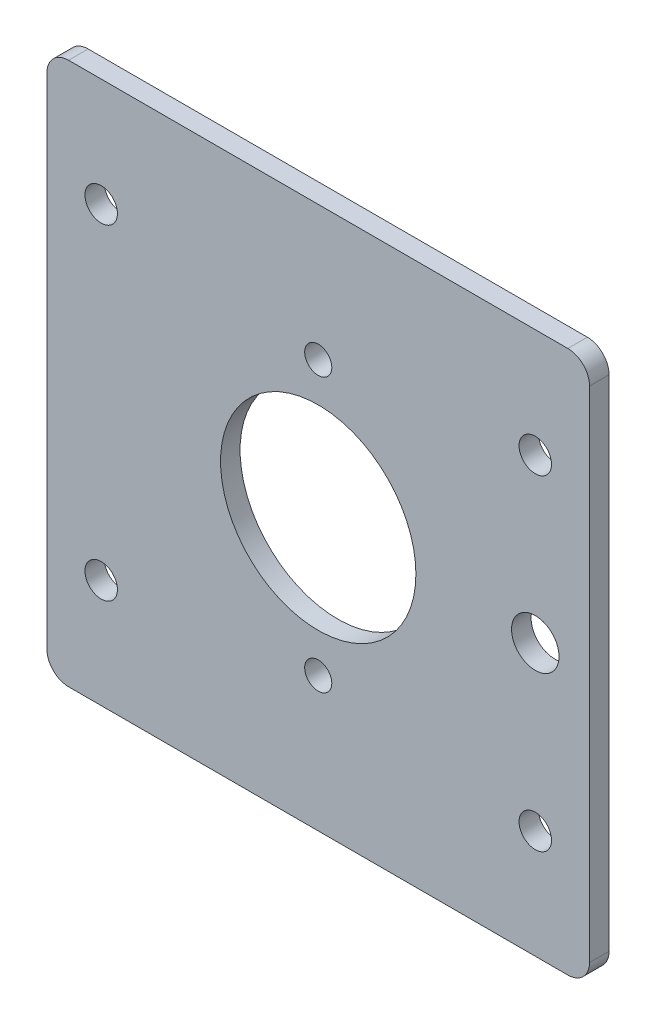
ISO-10303-21;
HEADER;
FILE_DESCRIPTION(('STEP AP214'),'2;1');
FILE_NAME('part.step','',(''),(''),'','','');
FILE_SCHEMA(('AUTOMOTIVE_DESIGN { 1 0 10303 214 1 1 1 1 }'));
ENDSEC;
DATA;
#1=APPLICATION_CONTEXT('core data for automotive mechanical design processes');
#2=APPLICATION_PROTOCOL_DEFINITION('international standard','automotive_design',2000,#1);
#3=PRODUCT_CONTEXT('',#1,'mechanical');
#4=PRODUCT('Part','Part','',(#3));
#5=PRODUCT_RELATED_PRODUCT_CATEGORY('part','',(#4));
#6=PRODUCT_DEFINITION_FORMATION('','',#4);
#7=PRODUCT_DEFINITION_CONTEXT('part definition',#1,'design');
#8=PRODUCT_DEFINITION('design','',#6,#7);
#9=PRODUCT_DEFINITION_SHAPE('','',#8);
#10=(LENGTH_UNIT() NAMED_UNIT(*) SI_UNIT(.MILLI.,.METRE.));
#11=(NAMED_UNIT(*) PLANE_ANGLE_UNIT() SI_UNIT($,.RADIAN.));
#12=(NAMED_UNIT(*) SI_UNIT($,.STERADIAN.) SOLID_ANGLE_UNIT());
#13=UNCERTAINTY_MEASURE_WITH_UNIT(LENGTH_MEASURE(1.E-05),#10,'distance_accuracy_value','');
#14=(GEOMETRIC_REPRESENTATION_CONTEXT(3) GLOBAL_UNCERTAINTY_ASSIGNED_CONTEXT((#13)) GLOBAL_UNIT_ASSIGNED_CONTEXT((#10,
#11,#12)) REPRESENTATION_CONTEXT('',''));
#15=CARTESIAN_POINT('',(0.,0.,0.));
#16=DIRECTION('',(0.,0.,1.));
#17=DIRECTION('',(1.,0.,0.));
#18=AXIS2_PLACEMENT_3D('',#15,#16,#17);
#19=CARTESIAN_POINT('',(31.75,31.75,-2.286));
#20=DIRECTION('',(0.,0.,1.));
#21=DIRECTION('',(1.,0.,0.));
#22=AXIS2_PLACEMENT_3D('',#19,#20,#21);
#23=PLANE('',#22);
#24=CARTESIAN_POINT('',(0.,16.,-2.28599999999999));
#25=DIRECTION('',(0.,0.,1.));
#26=DIRECTION('',(1.,0.,0.));
#27=AXIS2_PLACEMENT_3D('',#24,#25,#26);
#28=CIRCLE('',#27,1.5875);
#29=CARTESIAN_POINT('',(1.5875,16.,-2.28599999999999));
#30=VERTEX_POINT('',#29);
#31=EDGE_CURVE('E225',#30,#30,#28,.T.);
#32=ORIENTED_EDGE('',*,*,#31,.T.);
#33=EDGE_LOOP('',(#32));
#34=FACE_BOUND('',#33,.T.);
#35=CARTESIAN_POINT('',(0.,-16.,-2.28599999999999));
#36=DIRECTION('',(0.,0.,1.));
#37=DIRECTION('',(1.,0.,0.));
#38=AXIS2_PLACEMENT_3D('',#35,#36,#37);
#39=CIRCLE('',#38,1.5875);
#40=CARTESIAN_POINT('',(1.5875,-16.,-2.28599999999999));
#41=VERTEX_POINT('',#40);
#42=EDGE_CURVE('E219',#41,#41,#39,.T.);
#43=ORIENTED_EDGE('',*,*,#42,.T.);
#44=EDGE_LOOP('',(#43));
#45=FACE_BOUND('',#44,.T.);
#46=CARTESIAN_POINT('',(25.4,0.,-2.286));
#47=DIRECTION('',(0.,0.,1.));
#48=DIRECTION('',(1.,0.,0.));
#49=AXIS2_PLACEMENT_3D('',#46,#47,#48);
#50=CIRCLE('',#49,2.778125);
#51=CARTESIAN_POINT('',(28.178125,0.,-2.286));
#52=VERTEX_POINT('',#51);
#53=EDGE_CURVE('E211',#52,#52,#50,.T.);
#54=ORIENTED_EDGE('',*,*,#53,.T.);
#55=EDGE_LOOP('',(#54));
#56=FACE_BOUND('',#55,.T.);
#57=CARTESIAN_POINT('',(0.,0.,-2.286));
#58=DIRECTION('',(0.,0.,1.));
#59=DIRECTION('',(1.,0.,0.));
#60=AXIS2_PLACEMENT_3D('',#57,#58,#59);
#61=CIRCLE('',#60,11.43);
#62=CARTESIAN_POINT('',(11.43,0.,-2.286));
#63=VERTEX_POINT('',#62);
#64=EDGE_CURVE('E207',#63,#63,#61,.T.);
#65=ORIENTED_EDGE('',*,*,#64,.T.);
#66=EDGE_LOOP('',(#65));
#67=FACE_BOUND('',#66,.T.);
#68=CARTESIAN_POINT('',(-25.4,19.05,-2.286));
#69=DIRECTION('',(0.,0.,1.));
#70=DIRECTION('',(1.,0.,0.));
#71=AXIS2_PLACEMENT_3D('',#68,#69,#70);
#72=CIRCLE('',#71,1.89865);
#73=CARTESIAN_POINT('',(-23.50135,19.05,-2.286));
#74=VERTEX_POINT('',#73);
#75=EDGE_CURVE('E201',#74,#74,#72,.T.);
#76=ORIENTED_EDGE('',*,*,#75,.T.);
#77=EDGE_LOOP('',(#76));
#78=FACE_BOUND('',#77,.T.);
#79=CARTESIAN_POINT('',(25.4,19.05,-2.286));
#80=DIRECTION('',(0.,0.,1.));
#81=DIRECTION('',(1.,0.,0.));
#82=AXIS2_PLACEMENT_3D('',#79,#80,#81);
#83=CIRCLE('',#82,1.89865);
#84=CARTESIAN_POINT('',(27.29865,19.05,-2.286));
#85=VERTEX_POINT('',#84);
#86=EDGE_CURVE('E195',#85,#85,#83,.T.);
#87=ORIENTED_EDGE('',*,*,#86,.T.);
#88=EDGE_LOOP('',(#87));
#89=FACE_BOUND('',#88,.T.);
#90=CARTESIAN_POINT('',(25.4,-19.05,-2.286));
#91=DIRECTION('',(0.,0.,1.));
#92=DIRECTION('',(1.,0.,0.));
#93=AXIS2_PLACEMENT_3D('',#90,#91,#92);
#94=CIRCLE('',#93,1.89865);
#95=CARTESIAN_POINT('',(27.29865,-19.05,-2.286));
#96=VERTEX_POINT('',#95);
#97=EDGE_CURVE('E189',#96,#96,#94,.T.);
#98=ORIENTED_EDGE('',*,*,#97,.T.);
#99=EDGE_LOOP('',(#98));
#100=FACE_BOUND('',#99,.T.);
#101=CARTESIAN_POINT('',(-25.4,-19.05,-2.286));
#102=DIRECTION('',(0.,0.,1.));
#103=DIRECTION('',(1.,0.,0.));
#104=AXIS2_PLACEMENT_3D('',#101,#102,#103);
#105=CIRCLE('',#104,1.89865);
#106=CARTESIAN_POINT('',(-23.50135,-19.05,-2.286));
#107=VERTEX_POINT('',#106);
#108=EDGE_CURVE('E130',#107,#107,#105,.T.);
#109=ORIENTED_EDGE('',*,*,#108,.T.);
#110=EDGE_LOOP('',(#109));
#111=FACE_BOUND('',#110,.T.);
#112=DIRECTION('',(0.,-1.,0.));
#113=VECTOR('',#112,1.);
#114=CARTESIAN_POINT('',(31.75,31.75,-2.286));
#115=LINE('',#114,#113);
#116=CARTESIAN_POINT('',(31.75,29.21,-2.286));
#117=VERTEX_POINT('',#116);
#118=CARTESIAN_POINT('',(31.75,-29.21,-2.286));
#119=VERTEX_POINT('',#118);
#120=EDGE_CURVE('E113',#117,#119,#115,.T.);
#121=ORIENTED_EDGE('',*,*,#120,.T.);
#122=CARTESIAN_POINT('',(29.21,-29.21,-2.286));
#123=DIRECTION('',(0.,0.,1.));
#124=DIRECTION('',(1.,0.,0.));
#125=AXIS2_PLACEMENT_3D('',#122,#123,#124);
#126=CIRCLE('',#125,2.54);
#127=CARTESIAN_POINT('',(29.21,-31.75,-2.286));
#128=VERTEX_POINT('',#127);
#129=EDGE_CURVE('E109',#119,#128,#126,.F.);
#130=ORIENTED_EDGE('',*,*,#129,.T.);
#131=DIRECTION('',(-1.,0.,0.));
#132=VECTOR('',#131,1.);
#133=CARTESIAN_POINT('',(31.75,-31.75,-2.286));
#134=LINE('',#133,#132);
#135=CARTESIAN_POINT('',(-29.21,-31.75,-2.28599999999999));
#136=VERTEX_POINT('',#135);
#137=EDGE_CURVE('E111',#128,#136,#134,.T.);
#138=ORIENTED_EDGE('',*,*,#137,.T.);
#139=CARTESIAN_POINT('',(-29.21,-29.21,-2.28599999999999));
#140=DIRECTION('',(0.,0.,1.));
#141=DIRECTION('',(1.,0.,0.));
#142=AXIS2_PLACEMENT_3D('',#139,#140,#141);
#143=CIRCLE('',#142,2.54);
#144=CARTESIAN_POINT('',(-31.75,-29.21,-2.28599999999999));
#145=VERTEX_POINT('',#144);
#146=EDGE_CURVE('E118',#136,#145,#143,.F.);
#147=ORIENTED_EDGE('',*,*,#146,.T.);
#148=DIRECTION('',(0.,-1.,0.));
#149=VECTOR('',#148,1.);
#150=CARTESIAN_POINT('',(-31.75,31.75,-2.28599999999999));
#151=LINE('',#150,#149);
#152=CARTESIAN_POINT('',(-31.75,29.21,-2.28599999999999));
#153=VERTEX_POINT('',#152);
#154=EDGE_CURVE('E138',#153,#145,#151,.T.);
#155=ORIENTED_EDGE('',*,*,#154,.F.);
#156=CARTESIAN_POINT('',(-29.21,29.21,-2.28599999999999));
#157=DIRECTION('',(0.,0.,1.));
#158=DIRECTION('',(1.,0.,0.));
#159=AXIS2_PLACEMENT_3D('',#156,#157,#158);
#160=CIRCLE('',#159,2.54);
#161=CARTESIAN_POINT('',(-29.21,31.75,-2.28599999999999));
#162=VERTEX_POINT('',#161);
#163=EDGE_CURVE('E60',#153,#162,#160,.F.);
#164=ORIENTED_EDGE('',*,*,#163,.T.);
#165=DIRECTION('',(-1.,0.,0.));
#166=VECTOR('',#165,1.);
#167=CARTESIAN_POINT('',(31.75,31.75,-2.286));
#168=LINE('',#167,#166);
#169=CARTESIAN_POINT('',(29.21,31.75,-2.286));
#170=VERTEX_POINT('',#169);
#171=EDGE_CURVE('E180',#170,#162,#168,.T.);
#172=ORIENTED_EDGE('',*,*,#171,.F.);
#173=CARTESIAN_POINT('',(29.21,29.21,-2.286));
#174=DIRECTION('',(0.,0.,1.));
#175=DIRECTION('',(1.,0.,0.));
#176=AXIS2_PLACEMENT_3D('',#173,#174,#175);
#177=CIRCLE('',#176,2.54);
#178=EDGE_CURVE('E151',#170,#117,#177,.F.);
#179=ORIENTED_EDGE('',*,*,#178,.T.);
#180=EDGE_LOOP('',(#121,#130,#138,#147,#155,#164,#172,#179));
#181=FACE_BOUND('',#180,.T.);
#182=ADVANCED_FACE('F45',(#34,#45,#56,#67,#78,#89,#100,#111,#181),#23,.F.);
#183=CARTESIAN_POINT('',(-31.75,31.75,0.));
#184=DIRECTION('',(-1.,0.,0.));
#185=DIRECTION('',(0.,0.,1.));
#186=AXIS2_PLACEMENT_3D('',#183,#184,#185);
#187=PLANE('',#186);
#188=ORIENTED_EDGE('',*,*,#154,.T.);
#189=DIRECTION('',(0.,0.,-1.));
#190=VECTOR('',#189,1.);
#191=CARTESIAN_POINT('',(-31.75,-29.21,0.));
#192=LINE('',#191,#190);
#193=CARTESIAN_POINT('',(-31.75,-29.21,0.));
#194=VERTEX_POINT('',#193);
#195=EDGE_CURVE('E157',#145,#194,#192,.F.);
#196=ORIENTED_EDGE('',*,*,#195,.T.);
#197=DIRECTION('',(0.,-1.,0.));
#198=VECTOR('',#197,1.);
#199=CARTESIAN_POINT('',(-31.75,31.75,0.));
#200=LINE('',#199,#198);
#201=CARTESIAN_POINT('',(-31.75,29.21,0.));
#202=VERTEX_POINT('',#201);
#203=EDGE_CURVE('E164',#202,#194,#200,.T.);
#204=ORIENTED_EDGE('',*,*,#203,.F.);
#205=DIRECTION('',(0.,0.,-1.));
#206=VECTOR('',#205,1.);
#207=CARTESIAN_POINT('',(-31.75,29.21,-2.28599999999999));
#208=LINE('',#207,#206);
#209=EDGE_CURVE('E117',#202,#153,#208,.T.);
#210=ORIENTED_EDGE('',*,*,#209,.T.);
#211=EDGE_LOOP('',(#188,#196,#204,#210));
#212=FACE_BOUND('',#211,.T.);
#213=ADVANCED_FACE('F163',(#212),#187,.T.);
#214=CARTESIAN_POINT('',(31.75,31.75,0.));
#215=DIRECTION('',(0.,0.,1.));
#216=DIRECTION('',(1.,0.,0.));
#217=AXIS2_PLACEMENT_3D('',#214,#215,#216);
#218=PLANE('',#217);
#219=CARTESIAN_POINT('',(0.,16.,0.));
#220=DIRECTION('',(0.,0.,1.));
#221=DIRECTION('',(1.,0.,0.));
#222=AXIS2_PLACEMENT_3D('',#219,#220,#221);
#223=CIRCLE('',#222,1.5875);
#224=CARTESIAN_POINT('',(1.5875,16.,0.));
#225=VERTEX_POINT('',#224);
#226=EDGE_CURVE('E228',#225,#225,#223,.T.);
#227=ORIENTED_EDGE('',*,*,#226,.F.);
#228=EDGE_LOOP('',(#227));
#229=FACE_BOUND('',#228,.T.);
#230=CARTESIAN_POINT('',(0.,-16.,0.));
#231=DIRECTION('',(0.,0.,1.));
#232=DIRECTION('',(1.,0.,0.));
#233=AXIS2_PLACEMENT_3D('',#230,#231,#232);
#234=CIRCLE('',#233,1.5875);
#235=CARTESIAN_POINT('',(1.5875,-16.,0.));
#236=VERTEX_POINT('',#235);
#237=EDGE_CURVE('E222',#236,#236,#234,.T.);
#238=ORIENTED_EDGE('',*,*,#237,.F.);
#239=EDGE_LOOP('',(#238));
#240=FACE_BOUND('',#239,.T.);
#241=CARTESIAN_POINT('',(25.4,0.,0.));
#242=DIRECTION('',(0.,0.,1.));
#243=DIRECTION('',(1.,0.,0.));
#244=AXIS2_PLACEMENT_3D('',#241,#242,#243);
#245=CIRCLE('',#244,2.77812499999999);
#246=CARTESIAN_POINT('',(28.178125,0.,0.));
#247=VERTEX_POINT('',#246);
#248=EDGE_CURVE('E216',#247,#247,#245,.T.);
#249=ORIENTED_EDGE('',*,*,#248,.F.);
#250=EDGE_LOOP('',(#249));
#251=FACE_BOUND('',#250,.T.);
#252=CARTESIAN_POINT('',(0.,0.,0.));
#253=DIRECTION('',(0.,0.,1.));
#254=DIRECTION('',(1.,0.,0.));
#255=AXIS2_PLACEMENT_3D('',#252,#253,#254);
#256=CIRCLE('',#255,11.43);
#257=CARTESIAN_POINT('',(11.43,0.,0.));
#258=VERTEX_POINT('',#257);
#259=EDGE_CURVE('E208',#258,#258,#256,.T.);
#260=ORIENTED_EDGE('',*,*,#259,.F.);
#261=EDGE_LOOP('',(#260));
#262=FACE_BOUND('',#261,.T.);
#263=CARTESIAN_POINT('',(-25.4,19.05,0.));
#264=DIRECTION('',(0.,0.,1.));
#265=DIRECTION('',(1.,0.,0.));
#266=AXIS2_PLACEMENT_3D('',#263,#264,#265);
#267=CIRCLE('',#266,1.89865);
#268=CARTESIAN_POINT('',(-23.50135,19.05,0.));
#269=VERTEX_POINT('',#268);
#270=EDGE_CURVE('E204',#269,#269,#267,.T.);
#271=ORIENTED_EDGE('',*,*,#270,.F.);
#272=EDGE_LOOP('',(#271));
#273=FACE_BOUND('',#272,.T.);
#274=CARTESIAN_POINT('',(25.4,19.05,0.));
#275=DIRECTION('',(0.,0.,1.));
#276=DIRECTION('',(1.,0.,0.));
#277=AXIS2_PLACEMENT_3D('',#274,#275,#276);
#278=CIRCLE('',#277,1.89865);
#279=CARTESIAN_POINT('',(27.29865,19.05,0.));
#280=VERTEX_POINT('',#279);
#281=EDGE_CURVE('E198',#280,#280,#278,.T.);
#282=ORIENTED_EDGE('',*,*,#281,.F.);
#283=EDGE_LOOP('',(#282));
#284=FACE_BOUND('',#283,.T.);
#285=CARTESIAN_POINT('',(25.4,-19.05,0.));
#286=DIRECTION('',(0.,0.,1.));
#287=DIRECTION('',(1.,0.,0.));
#288=AXIS2_PLACEMENT_3D('',#285,#286,#287);
#289=CIRCLE('',#288,1.89865);
#290=CARTESIAN_POINT('',(27.29865,-19.05,0.));
#291=VERTEX_POINT('',#290);
#292=EDGE_CURVE('E192',#291,#291,#289,.T.);
#293=ORIENTED_EDGE('',*,*,#292,.F.);
#294=EDGE_LOOP('',(#293));
#295=FACE_BOUND('',#294,.T.);
#296=CARTESIAN_POINT('',(-25.4,-19.05,0.));
#297=DIRECTION('',(0.,0.,1.));
#298=DIRECTION('',(1.,0.,0.));
#299=AXIS2_PLACEMENT_3D('',#296,#297,#298);
#300=CIRCLE('',#299,1.89865);
#301=CARTESIAN_POINT('',(-23.50135,-19.05,0.));
#302=VERTEX_POINT('',#301);
#303=EDGE_CURVE('E186',#302,#302,#300,.T.);
#304=ORIENTED_EDGE('',*,*,#303,.F.);
#305=EDGE_LOOP('',(#304));
#306=FACE_BOUND('',#305,.T.);
#307=DIRECTION('',(-1.,0.,0.));
#308=VECTOR('',#307,1.);
#309=CARTESIAN_POINT('',(31.75,-31.75,0.));
#310=LINE('',#309,#308);
#311=CARTESIAN_POINT('',(29.21,-31.75,0.));
#312=VERTEX_POINT('',#311);
#313=CARTESIAN_POINT('',(-29.21,-31.75,0.));
#314=VERTEX_POINT('',#313);
#315=EDGE_CURVE('E129',#312,#314,#310,.T.);
#316=ORIENTED_EDGE('',*,*,#315,.F.);
#317=CARTESIAN_POINT('',(29.21,-29.21,0.));
#318=DIRECTION('',(0.,0.,1.));
#319=DIRECTION('',(1.,0.,0.));
#320=AXIS2_PLACEMENT_3D('',#317,#318,#319);
#321=CIRCLE('',#320,2.54);
#322=CARTESIAN_POINT('',(31.75,-29.21,0.));
#323=VERTEX_POINT('',#322);
#324=EDGE_CURVE('E133',#312,#323,#321,.T.);
#325=ORIENTED_EDGE('',*,*,#324,.T.);
#326=DIRECTION('',(0.,-1.,0.));
#327=VECTOR('',#326,1.);
#328=CARTESIAN_POINT('',(31.75,31.75,0.));
#329=LINE('',#328,#327);
#330=CARTESIAN_POINT('',(31.75,29.21,0.));
#331=VERTEX_POINT('',#330);
#332=EDGE_CURVE('E172',#331,#323,#329,.T.);
#333=ORIENTED_EDGE('',*,*,#332,.F.);
#334=CARTESIAN_POINT('',(29.21,29.21,0.));
#335=DIRECTION('',(0.,0.,1.));
#336=DIRECTION('',(1.,0.,0.));
#337=AXIS2_PLACEMENT_3D('',#334,#335,#336);
#338=CIRCLE('',#337,2.54);
#339=CARTESIAN_POINT('',(29.21,31.75,0.));
#340=VERTEX_POINT('',#339);
#341=EDGE_CURVE('E134',#331,#340,#338,.T.);
#342=ORIENTED_EDGE('',*,*,#341,.T.);
#343=DIRECTION('',(-1.,0.,0.));
#344=VECTOR('',#343,1.);
#345=CARTESIAN_POINT('',(31.75,31.75,0.));
#346=LINE('',#345,#344);
#347=CARTESIAN_POINT('',(-29.21,31.75,0.));
#348=VERTEX_POINT('',#347);
#349=EDGE_CURVE('E179',#340,#348,#346,.T.);
#350=ORIENTED_EDGE('',*,*,#349,.T.);
#351=CARTESIAN_POINT('',(-29.21,29.21,0.));
#352=DIRECTION('',(0.,0.,1.));
#353=DIRECTION('',(1.,0.,0.));
#354=AXIS2_PLACEMENT_3D('',#351,#352,#353);
#355=CIRCLE('',#354,2.54);
#356=EDGE_CURVE('E136',#348,#202,#355,.T.);
#357=ORIENTED_EDGE('',*,*,#356,.T.);
#358=ORIENTED_EDGE('',*,*,#203,.T.);
#359=CARTESIAN_POINT('',(-29.21,-29.21,0.));
#360=DIRECTION('',(0.,0.,1.));
#361=DIRECTION('',(1.,0.,0.));
#362=AXIS2_PLACEMENT_3D('',#359,#360,#361);
#363=CIRCLE('',#362,2.54);
#364=EDGE_CURVE('E143',#194,#314,#363,.T.);
#365=ORIENTED_EDGE('',*,*,#364,.T.);
#366=EDGE_LOOP('',(#316,#325,#333,#342,#350,#357,#358,#365));
#367=FACE_BOUND('',#366,.T.);
#368=ADVANCED_FACE('F169',(#229,#240,#251,#262,#273,#284,#295,#306,#367),#218,.T.);
#369=CARTESIAN_POINT('',(31.75,31.75,-2.286));
#370=DIRECTION('',(1.,0.,0.));
#371=DIRECTION('',(0.,0.,-1.));
#372=AXIS2_PLACEMENT_3D('',#369,#370,#371);
#373=PLANE('',#372);
#374=ORIENTED_EDGE('',*,*,#332,.T.);
#375=DIRECTION('',(0.,0.,1.));
#376=VECTOR('',#375,1.);
#377=CARTESIAN_POINT('',(31.75,-29.21,-2.286));
#378=LINE('',#377,#376);
#379=EDGE_CURVE('E149',#323,#119,#378,.F.);
#380=ORIENTED_EDGE('',*,*,#379,.T.);
#381=ORIENTED_EDGE('',*,*,#120,.F.);
#382=DIRECTION('',(0.,0.,1.));
#383=VECTOR('',#382,1.);
#384=CARTESIAN_POINT('',(31.75,29.21,0.));
#385=LINE('',#384,#383);
#386=EDGE_CURVE('E146',#117,#331,#385,.T.);
#387=ORIENTED_EDGE('',*,*,#386,.T.);
#388=EDGE_LOOP('',(#374,#380,#381,#387));
#389=FACE_BOUND('',#388,.T.);
#390=ADVANCED_FACE('F236',(#389),#373,.T.);
#391=CARTESIAN_POINT('',(0.,31.75,0.));
#392=DIRECTION('',(0.,-1.,0.));
#393=DIRECTION('',(1.,0.,0.));
#394=AXIS2_PLACEMENT_3D('',#391,#392,#393);
#395=PLANE('',#394);
#396=ORIENTED_EDGE('',*,*,#171,.T.);
#397=DIRECTION('',(0.,0.,-1.));
#398=VECTOR('',#397,1.);
#399=CARTESIAN_POINT('',(-29.21,31.75,0.));
#400=LINE('',#399,#398);
#401=EDGE_CURVE('E11',#162,#348,#400,.F.);
#402=ORIENTED_EDGE('',*,*,#401,.T.);
#403=ORIENTED_EDGE('',*,*,#349,.F.);
#404=DIRECTION('',(0.,0.,1.));
#405=VECTOR('',#404,1.);
#406=CARTESIAN_POINT('',(29.21,31.75,-2.286));
#407=LINE('',#406,#405);
#408=EDGE_CURVE('E53',#340,#170,#407,.F.);
#409=ORIENTED_EDGE('',*,*,#408,.T.);
#410=EDGE_LOOP('',(#396,#402,#403,#409));
#411=FACE_BOUND('',#410,.T.);
#412=ADVANCED_FACE('F286',(#411),#395,.F.);
#413=CARTESIAN_POINT('',(0.,-31.75,0.));
#414=DIRECTION('',(0.,-1.,0.));
#415=DIRECTION('',(1.,0.,0.));
#416=AXIS2_PLACEMENT_3D('',#413,#414,#415);
#417=PLANE('',#416);
#418=ORIENTED_EDGE('',*,*,#137,.F.);
#419=DIRECTION('',(0.,0.,1.));
#420=VECTOR('',#419,1.);
#421=CARTESIAN_POINT('',(29.21,-31.75,0.));
#422=LINE('',#421,#420);
#423=EDGE_CURVE('E125',#128,#312,#422,.T.);
#424=ORIENTED_EDGE('',*,*,#423,.T.);
#425=ORIENTED_EDGE('',*,*,#315,.T.);
#426=DIRECTION('',(0.,0.,-1.));
#427=VECTOR('',#426,1.);
#428=CARTESIAN_POINT('',(-29.21,-31.75,0.));
#429=LINE('',#428,#427);
#430=EDGE_CURVE('E128',#314,#136,#429,.T.);
#431=ORIENTED_EDGE('',*,*,#430,.T.);
#432=EDGE_LOOP('',(#418,#424,#425,#431));
#433=FACE_BOUND('',#432,.T.);
#434=ADVANCED_FACE('F123',(#433),#417,.T.);
#435=CARTESIAN_POINT('',(29.21,-29.21,0.));
#436=DIRECTION('',(0.,0.,1.));
#437=DIRECTION('',(1.,0.,0.));
#438=AXIS2_PLACEMENT_3D('',#435,#436,#437);
#439=CYLINDRICAL_SURFACE('',#438,2.54);
#440=ORIENTED_EDGE('',*,*,#129,.F.);
#441=ORIENTED_EDGE('',*,*,#379,.F.);
#442=ORIENTED_EDGE('',*,*,#324,.F.);
#443=ORIENTED_EDGE('',*,*,#423,.F.);
#444=EDGE_LOOP('',(#440,#441,#442,#443));
#445=FACE_BOUND('',#444,.T.);
#446=ADVANCED_FACE('F132',(#445),#439,.T.);
#447=CARTESIAN_POINT('',(-29.21,-29.21,0.));
#448=DIRECTION('',(0.,0.,-1.));
#449=DIRECTION('',(-1.,0.,0.));
#450=AXIS2_PLACEMENT_3D('',#447,#448,#449);
#451=CYLINDRICAL_SURFACE('',#450,2.54);
#452=ORIENTED_EDGE('',*,*,#364,.F.);
#453=ORIENTED_EDGE('',*,*,#195,.F.);
#454=ORIENTED_EDGE('',*,*,#146,.F.);
#455=ORIENTED_EDGE('',*,*,#430,.F.);
#456=EDGE_LOOP('',(#452,#453,#454,#455));
#457=FACE_BOUND('',#456,.T.);
#458=ADVANCED_FACE('F174',(#457),#451,.T.);
#459=CARTESIAN_POINT('',(-29.21,29.21,0.));
#460=DIRECTION('',(0.,0.,1.));
#461=DIRECTION('',(1.,0.,0.));
#462=AXIS2_PLACEMENT_3D('',#459,#460,#461);
#463=CYLINDRICAL_SURFACE('',#462,2.54);
#464=ORIENTED_EDGE('',*,*,#356,.F.);
#465=ORIENTED_EDGE('',*,*,#401,.F.);
#466=ORIENTED_EDGE('',*,*,#163,.F.);
#467=ORIENTED_EDGE('',*,*,#209,.F.);
#468=EDGE_LOOP('',(#464,#465,#466,#467));
#469=FACE_BOUND('',#468,.T.);
#470=ADVANCED_FACE('F264',(#469),#463,.T.);
#471=CARTESIAN_POINT('',(29.21,29.21,-2.286));
#472=DIRECTION('',(0.,0.,-1.));
#473=DIRECTION('',(-1.,0.,0.));
#474=AXIS2_PLACEMENT_3D('',#471,#472,#473);
#475=CYLINDRICAL_SURFACE('',#474,2.54);
#476=ORIENTED_EDGE('',*,*,#178,.F.);
#477=ORIENTED_EDGE('',*,*,#408,.F.);
#478=ORIENTED_EDGE('',*,*,#341,.F.);
#479=ORIENTED_EDGE('',*,*,#386,.F.);
#480=EDGE_LOOP('',(#476,#477,#478,#479));
#481=FACE_BOUND('',#480,.T.);
#482=ADVANCED_FACE('F47',(#481),#475,.T.);
#483=CARTESIAN_POINT('',(-25.4,-19.05,0.));
#484=DIRECTION('',(0.,0.,1.));
#485=DIRECTION('',(1.,0.,0.));
#486=AXIS2_PLACEMENT_3D('',#483,#484,#485);
#487=CYLINDRICAL_SURFACE('',#486,1.89865);
#488=ORIENTED_EDGE('',*,*,#108,.F.);
#489=EDGE_LOOP('',(#488));
#490=FACE_BOUND('',#489,.T.);
#491=ORIENTED_EDGE('',*,*,#303,.T.);
#492=EDGE_LOOP('',(#491));
#493=FACE_BOUND('',#492,.T.);
#494=ADVANCED_FACE('F252',(#490,#493),#487,.F.);
#495=CARTESIAN_POINT('',(25.4,-19.05,0.));
#496=DIRECTION('',(0.,0.,1.));
#497=DIRECTION('',(1.,0.,0.));
#498=AXIS2_PLACEMENT_3D('',#495,#496,#497);
#499=CYLINDRICAL_SURFACE('',#498,1.89865);
#500=ORIENTED_EDGE('',*,*,#97,.F.);
#501=EDGE_LOOP('',(#500));
#502=FACE_BOUND('',#501,.T.);
#503=ORIENTED_EDGE('',*,*,#292,.T.);
#504=EDGE_LOOP('',(#503));
#505=FACE_BOUND('',#504,.T.);
#506=ADVANCED_FACE('F254',(#502,#505),#499,.F.);
#507=CARTESIAN_POINT('',(25.4,19.05,0.));
#508=DIRECTION('',(0.,0.,1.));
#509=DIRECTION('',(1.,0.,0.));
#510=AXIS2_PLACEMENT_3D('',#507,#508,#509);
#511=CYLINDRICAL_SURFACE('',#510,1.89865);
#512=ORIENTED_EDGE('',*,*,#86,.F.);
#513=EDGE_LOOP('',(#512));
#514=FACE_BOUND('',#513,.T.);
#515=ORIENTED_EDGE('',*,*,#281,.T.);
#516=EDGE_LOOP('',(#515));
#517=FACE_BOUND('',#516,.T.);
#518=ADVANCED_FACE('F261',(#514,#517),#511,.F.);
#519=CARTESIAN_POINT('',(-25.4,19.05,0.));
#520=DIRECTION('',(0.,0.,1.));
#521=DIRECTION('',(1.,0.,0.));
#522=AXIS2_PLACEMENT_3D('',#519,#520,#521);
#523=CYLINDRICAL_SURFACE('',#522,1.89865);
#524=ORIENTED_EDGE('',*,*,#75,.F.);
#525=EDGE_LOOP('',(#524));
#526=FACE_BOUND('',#525,.T.);
#527=ORIENTED_EDGE('',*,*,#270,.T.);
#528=EDGE_LOOP('',(#527));
#529=FACE_BOUND('',#528,.T.);
#530=ADVANCED_FACE('F342',(#526,#529),#523,.F.);
#531=CARTESIAN_POINT('',(0.,0.,-2.286));
#532=DIRECTION('',(0.,0.,1.));
#533=DIRECTION('',(1.,0.,0.));
#534=AXIS2_PLACEMENT_3D('',#531,#532,#533);
#535=CYLINDRICAL_SURFACE('',#534,11.43);
#536=ORIENTED_EDGE('',*,*,#64,.F.);
#537=EDGE_LOOP('',(#536));
#538=FACE_BOUND('',#537,.T.);
#539=ORIENTED_EDGE('',*,*,#259,.T.);
#540=EDGE_LOOP('',(#539));
#541=FACE_BOUND('',#540,.T.);
#542=ADVANCED_FACE('F352',(#538,#541),#535,.F.);
#543=CARTESIAN_POINT('',(25.4,0.,0.));
#544=DIRECTION('',(0.,0.,1.));
#545=DIRECTION('',(1.,0.,0.));
#546=AXIS2_PLACEMENT_3D('',#543,#544,#545);
#547=CYLINDRICAL_SURFACE('',#546,2.778125);
#548=ORIENTED_EDGE('',*,*,#53,.F.);
#549=EDGE_LOOP('',(#548));
#550=FACE_BOUND('',#549,.T.);
#551=ORIENTED_EDGE('',*,*,#248,.T.);
#552=EDGE_LOOP('',(#551));
#553=FACE_BOUND('',#552,.T.);
#554=ADVANCED_FACE('F362',(#550,#553),#547,.F.);
#555=CARTESIAN_POINT('',(0.,-16.,0.));
#556=DIRECTION('',(0.,0.,1.));
#557=DIRECTION('',(1.,0.,0.));
#558=AXIS2_PLACEMENT_3D('',#555,#556,#557);
#559=CYLINDRICAL_SURFACE('',#558,1.5875);
#560=ORIENTED_EDGE('',*,*,#42,.F.);
#561=EDGE_LOOP('',(#560));
#562=FACE_BOUND('',#561,.T.);
#563=ORIENTED_EDGE('',*,*,#237,.T.);
#564=EDGE_LOOP('',(#563));
#565=FACE_BOUND('',#564,.T.);
#566=ADVANCED_FACE('F372',(#562,#565),#559,.F.);
#567=CARTESIAN_POINT('',(0.,16.,0.));
#568=DIRECTION('',(0.,0.,1.));
#569=DIRECTION('',(1.,0.,0.));
#570=AXIS2_PLACEMENT_3D('',#567,#568,#569);
#571=CYLINDRICAL_SURFACE('',#570,1.5875);
#572=ORIENTED_EDGE('',*,*,#31,.F.);
#573=EDGE_LOOP('',(#572));
#574=FACE_BOUND('',#573,.T.);
#575=ORIENTED_EDGE('',*,*,#226,.T.);
#576=EDGE_LOOP('',(#575));
#577=FACE_BOUND('',#576,.T.);
#578=ADVANCED_FACE('F232',(#574,#577),#571,.F.);
#579=CLOSED_SHELL('',(#182,#213,#368,#390,#412,#434,#446,#458,#470,#482,#494,#506,#518,#530,
#542,#554,#566,#578));
#580=MANIFOLD_SOLID_BREP('B2',#579);
#581=ADVANCED_BREP_SHAPE_REPRESENTATION('',(#18,#580),#14);
#582=SHAPE_DEFINITION_REPRESENTATION(#9,#581);
ENDSEC;
END-ISO-10303-21;
